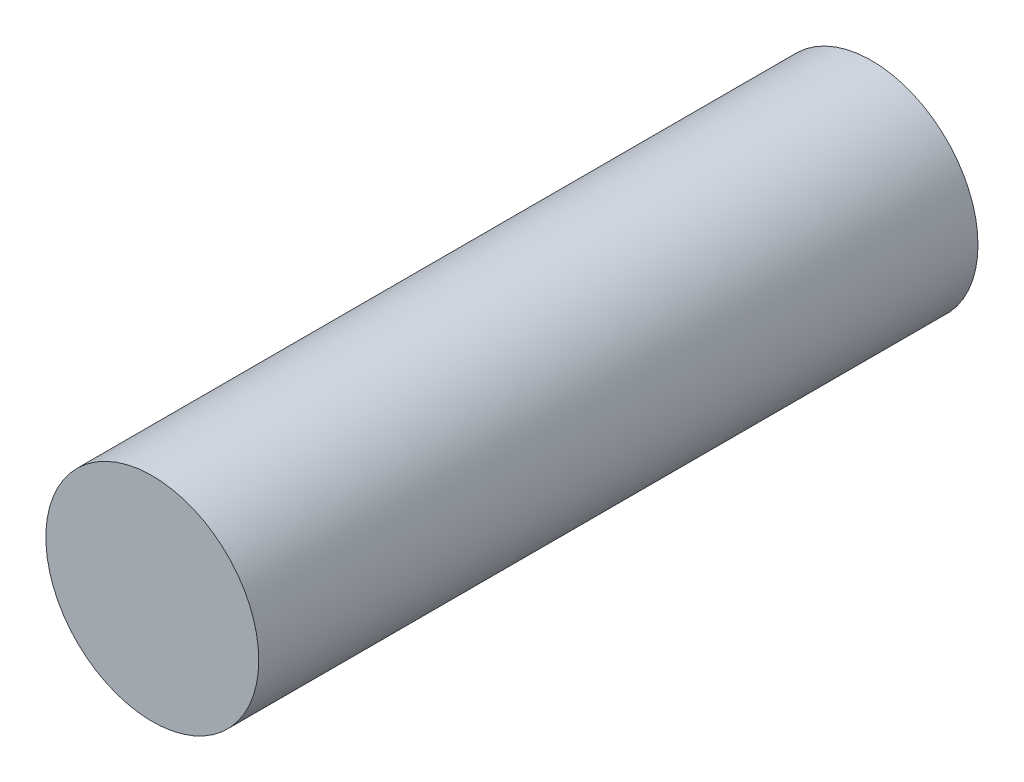
ISO-10303-21;
HEADER;
FILE_DESCRIPTION(('STEP AP214'),'2;1');
FILE_NAME('part.step','',(''),(''),'','','');
FILE_SCHEMA(('AUTOMOTIVE_DESIGN { 1 0 10303 214 1 1 1 1 }'));
ENDSEC;
DATA;
#1=APPLICATION_CONTEXT('core data for automotive mechanical design processes');
#2=APPLICATION_PROTOCOL_DEFINITION('international standard','automotive_design',2000,#1);
#3=PRODUCT_CONTEXT('',#1,'mechanical');
#4=PRODUCT('Part','Part','',(#3));
#5=PRODUCT_RELATED_PRODUCT_CATEGORY('part','',(#4));
#6=PRODUCT_DEFINITION_FORMATION('','',#4);
#7=PRODUCT_DEFINITION_CONTEXT('part definition',#1,'design');
#8=PRODUCT_DEFINITION('design','',#6,#7);
#9=PRODUCT_DEFINITION_SHAPE('','',#8);
#10=(LENGTH_UNIT() NAMED_UNIT(*) SI_UNIT(.MILLI.,.METRE.));
#11=(NAMED_UNIT(*) PLANE_ANGLE_UNIT() SI_UNIT($,.RADIAN.));
#12=(NAMED_UNIT(*) SI_UNIT($,.STERADIAN.) SOLID_ANGLE_UNIT());
#13=UNCERTAINTY_MEASURE_WITH_UNIT(LENGTH_MEASURE(1.E-05),#10,'distance_accuracy_value','');
#14=(GEOMETRIC_REPRESENTATION_CONTEXT(3) GLOBAL_UNCERTAINTY_ASSIGNED_CONTEXT((#13)) GLOBAL_UNIT_ASSIGNED_CONTEXT((#10,
#11,#12)) REPRESENTATION_CONTEXT('',''));
#15=CARTESIAN_POINT('',(0.,0.,0.));
#16=DIRECTION('',(0.,0.,1.));
#17=DIRECTION('',(1.,0.,0.));
#18=AXIS2_PLACEMENT_3D('',#15,#16,#17);
#19=CARTESIAN_POINT('',(0.,0.,25.));
#20=DIRECTION('',(0.,0.,-1.));
#21=DIRECTION('',(-1.,0.,0.));
#22=AXIS2_PLACEMENT_3D('',#19,#20,#21);
#23=CYLINDRICAL_SURFACE('',#22,7.4);
#24=CARTESIAN_POINT('',(0.,0.,25.));
#25=DIRECTION('',(0.,0.,1.));
#26=DIRECTION('',(1.,0.,0.));
#27=AXIS2_PLACEMENT_3D('',#24,#25,#26);
#28=CIRCLE('',#27,7.4);
#29=CARTESIAN_POINT('',(7.4,0.,25.));
#30=VERTEX_POINT('',#29);
#31=EDGE_CURVE('E10',#30,#30,#28,.T.);
#32=ORIENTED_EDGE('',*,*,#31,.F.);
#33=EDGE_LOOP('',(#32));
#34=FACE_BOUND('',#33,.T.);
#35=CARTESIAN_POINT('',(0.,0.,-25.));
#36=DIRECTION('',(0.,0.,1.));
#37=DIRECTION('',(1.,0.,0.));
#38=AXIS2_PLACEMENT_3D('',#35,#36,#37);
#39=CIRCLE('',#38,7.4);
#40=CARTESIAN_POINT('',(7.4,0.,-25.));
#41=VERTEX_POINT('',#40);
#42=EDGE_CURVE('E34',#41,#41,#39,.T.);
#43=ORIENTED_EDGE('',*,*,#42,.T.);
#44=EDGE_LOOP('',(#43));
#45=FACE_BOUND('',#44,.T.);
#46=ADVANCED_FACE('F31',(#34,#45),#23,.T.);
#47=CARTESIAN_POINT('',(0.,0.,25.));
#48=DIRECTION('',(0.,0.,1.));
#49=DIRECTION('',(1.,0.,0.));
#50=AXIS2_PLACEMENT_3D('',#47,#48,#49);
#51=PLANE('',#50);
#52=ORIENTED_EDGE('',*,*,#31,.T.);
#53=EDGE_LOOP('',(#52));
#54=FACE_BOUND('',#53,.T.);
#55=ADVANCED_FACE('F46',(#54),#51,.T.);
#56=CARTESIAN_POINT('',(0.,0.,-25.));
#57=DIRECTION('',(0.,0.,1.));
#58=DIRECTION('',(1.,0.,0.));
#59=AXIS2_PLACEMENT_3D('',#56,#57,#58);
#60=PLANE('',#59);
#61=ORIENTED_EDGE('',*,*,#42,.F.);
#62=EDGE_LOOP('',(#61));
#63=FACE_BOUND('',#62,.T.);
#64=ADVANCED_FACE('F44',(#63),#60,.F.);
#65=CLOSED_SHELL('',(#46,#55,#64));
#66=MANIFOLD_SOLID_BREP('B2',#65);
#67=ADVANCED_BREP_SHAPE_REPRESENTATION('',(#18,#66),#14);
#68=SHAPE_DEFINITION_REPRESENTATION(#9,#67);
ENDSEC;
END-ISO-10303-21;
